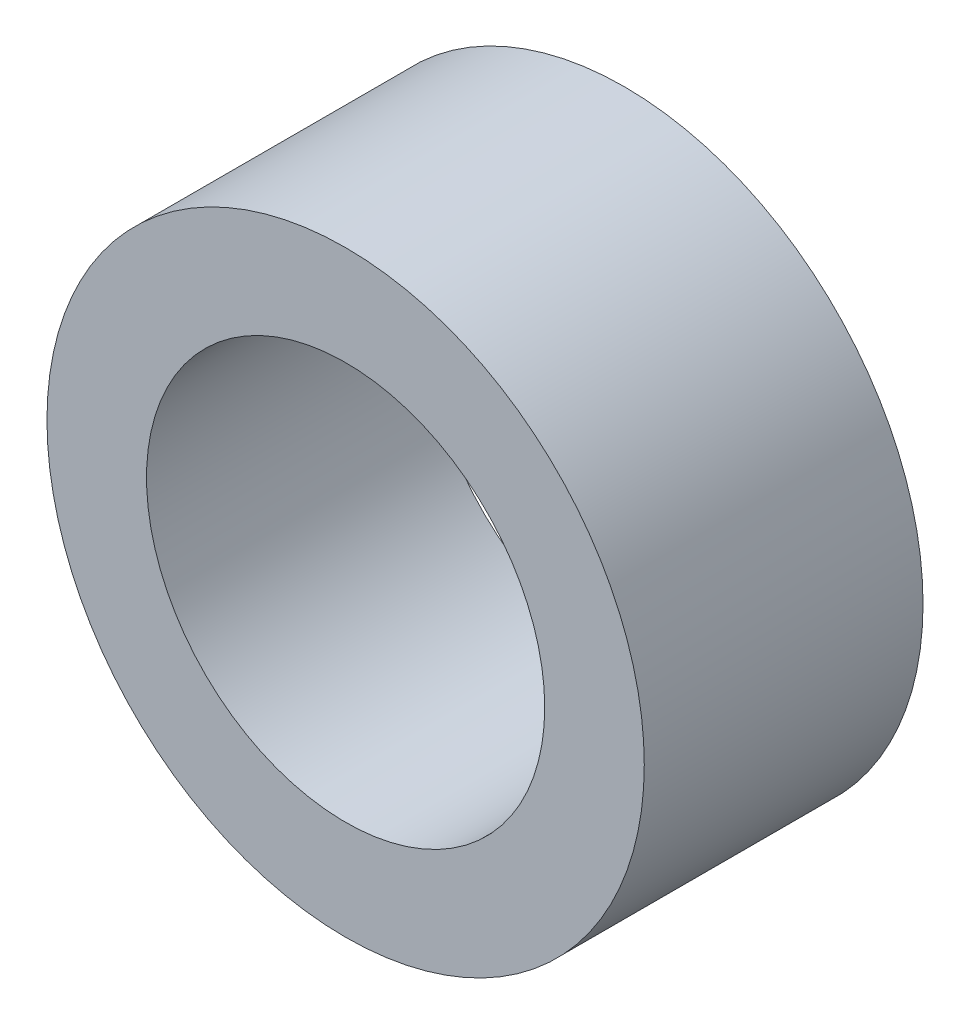
ISO-10303-21;
HEADER;
FILE_DESCRIPTION(('STEP AP214'),'2;1');
FILE_NAME('part.step','',(''),(''),'','','');
FILE_SCHEMA(('AUTOMOTIVE_DESIGN { 1 0 10303 214 1 1 1 1 }'));
ENDSEC;
DATA;
#1=APPLICATION_CONTEXT('core data for automotive mechanical design processes');
#2=APPLICATION_PROTOCOL_DEFINITION('international standard','automotive_design',2000,#1);
#3=PRODUCT_CONTEXT('',#1,'mechanical');
#4=PRODUCT('Part','Part','',(#3));
#5=PRODUCT_RELATED_PRODUCT_CATEGORY('part','',(#4));
#6=PRODUCT_DEFINITION_FORMATION('','',#4);
#7=PRODUCT_DEFINITION_CONTEXT('part definition',#1,'design');
#8=PRODUCT_DEFINITION('design','',#6,#7);
#9=PRODUCT_DEFINITION_SHAPE('','',#8);
#10=(LENGTH_UNIT() NAMED_UNIT(*) SI_UNIT(.MILLI.,.METRE.));
#11=(NAMED_UNIT(*) PLANE_ANGLE_UNIT() SI_UNIT($,.RADIAN.));
#12=(NAMED_UNIT(*) SI_UNIT($,.STERADIAN.) SOLID_ANGLE_UNIT());
#13=UNCERTAINTY_MEASURE_WITH_UNIT(LENGTH_MEASURE(1.E-05),#10,'distance_accuracy_value','');
#14=(GEOMETRIC_REPRESENTATION_CONTEXT(3) GLOBAL_UNCERTAINTY_ASSIGNED_CONTEXT((#13)) GLOBAL_UNIT_ASSIGNED_CONTEXT((#10,
#11,#12)) REPRESENTATION_CONTEXT('',''));
#15=CARTESIAN_POINT('',(0.,0.,0.));
#16=DIRECTION('',(0.,0.,1.));
#17=DIRECTION('',(1.,0.,0.));
#18=AXIS2_PLACEMENT_3D('',#15,#16,#17);
#19=CARTESIAN_POINT('',(0.,0.,28.));
#20=DIRECTION('',(0.,0.,1.));
#21=DIRECTION('',(1.,0.,0.));
#22=AXIS2_PLACEMENT_3D('',#19,#20,#21);
#23=PLANE('',#22);
#24=CARTESIAN_POINT('',(0.,0.,28.));
#25=DIRECTION('',(0.,0.,1.));
#26=DIRECTION('',(1.,0.,0.));
#27=AXIS2_PLACEMENT_3D('',#24,#25,#26);
#28=CIRCLE('',#27,30.);
#29=CARTESIAN_POINT('',(30.,0.,28.));
#30=VERTEX_POINT('',#29);
#31=EDGE_CURVE('E10',#30,#30,#28,.T.);
#32=ORIENTED_EDGE('',*,*,#31,.T.);
#33=EDGE_LOOP('',(#32));
#34=FACE_BOUND('',#33,.T.);
#35=CARTESIAN_POINT('',(0.,0.,28.));
#36=DIRECTION('',(0.,0.,1.));
#37=DIRECTION('',(1.,0.,0.));
#38=AXIS2_PLACEMENT_3D('',#35,#36,#37);
#39=CIRCLE('',#38,20.);
#40=CARTESIAN_POINT('',(20.,0.,28.));
#41=VERTEX_POINT('',#40);
#42=EDGE_CURVE('E42',#41,#41,#39,.T.);
#43=ORIENTED_EDGE('',*,*,#42,.F.);
#44=EDGE_LOOP('',(#43));
#45=FACE_BOUND('',#44,.T.);
#46=ADVANCED_FACE('F31',(#34,#45),#23,.T.);
#47=CARTESIAN_POINT('',(0.,0.,0.));
#48=DIRECTION('',(0.,0.,1.));
#49=DIRECTION('',(1.,0.,0.));
#50=AXIS2_PLACEMENT_3D('',#47,#48,#49);
#51=PLANE('',#50);
#52=CARTESIAN_POINT('',(0.,0.,0.));
#53=DIRECTION('',(0.,0.,1.));
#54=DIRECTION('',(1.,0.,0.));
#55=AXIS2_PLACEMENT_3D('',#52,#53,#54);
#56=CIRCLE('',#55,30.);
#57=CARTESIAN_POINT('',(30.,0.,0.));
#58=VERTEX_POINT('',#57);
#59=EDGE_CURVE('E35',#58,#58,#56,.T.);
#60=ORIENTED_EDGE('',*,*,#59,.F.);
#61=EDGE_LOOP('',(#60));
#62=FACE_BOUND('',#61,.T.);
#63=CARTESIAN_POINT('',(0.,0.,0.));
#64=DIRECTION('',(0.,0.,1.));
#65=DIRECTION('',(1.,0.,0.));
#66=AXIS2_PLACEMENT_3D('',#63,#64,#65);
#67=CIRCLE('',#66,20.);
#68=CARTESIAN_POINT('',(20.,0.,0.));
#69=VERTEX_POINT('',#68);
#70=EDGE_CURVE('E44',#69,#69,#67,.T.);
#71=ORIENTED_EDGE('',*,*,#70,.T.);
#72=EDGE_LOOP('',(#71));
#73=FACE_BOUND('',#72,.T.);
#74=ADVANCED_FACE('F54',(#62,#73),#51,.F.);
#75=CARTESIAN_POINT('',(0.,0.,28.));
#76=DIRECTION('',(0.,0.,-1.));
#77=DIRECTION('',(-1.,0.,0.));
#78=AXIS2_PLACEMENT_3D('',#75,#76,#77);
#79=CYLINDRICAL_SURFACE('',#78,30.);
#80=ORIENTED_EDGE('',*,*,#31,.F.);
#81=EDGE_LOOP('',(#80));
#82=FACE_BOUND('',#81,.T.);
#83=ORIENTED_EDGE('',*,*,#59,.T.);
#84=EDGE_LOOP('',(#83));
#85=FACE_BOUND('',#84,.T.);
#86=ADVANCED_FACE('F33',(#82,#85),#79,.T.);
#87=CARTESIAN_POINT('',(0.,0.,28.));
#88=DIRECTION('',(0.,0.,-1.));
#89=DIRECTION('',(-1.,0.,0.));
#90=AXIS2_PLACEMENT_3D('',#87,#88,#89);
#91=CYLINDRICAL_SURFACE('',#90,20.);
#92=ORIENTED_EDGE('',*,*,#42,.T.);
#93=EDGE_LOOP('',(#92));
#94=FACE_BOUND('',#93,.T.);
#95=ORIENTED_EDGE('',*,*,#70,.F.);
#96=EDGE_LOOP('',(#95));
#97=FACE_BOUND('',#96,.T.);
#98=ADVANCED_FACE('F50',(#94,#97),#91,.F.);
#99=CLOSED_SHELL('',(#46,#74,#86,#98));
#100=MANIFOLD_SOLID_BREP('B2',#99);
#101=ADVANCED_BREP_SHAPE_REPRESENTATION('',(#18,#100),#14);
#102=SHAPE_DEFINITION_REPRESENTATION(#9,#101);
ENDSEC;
END-ISO-10303-21;
